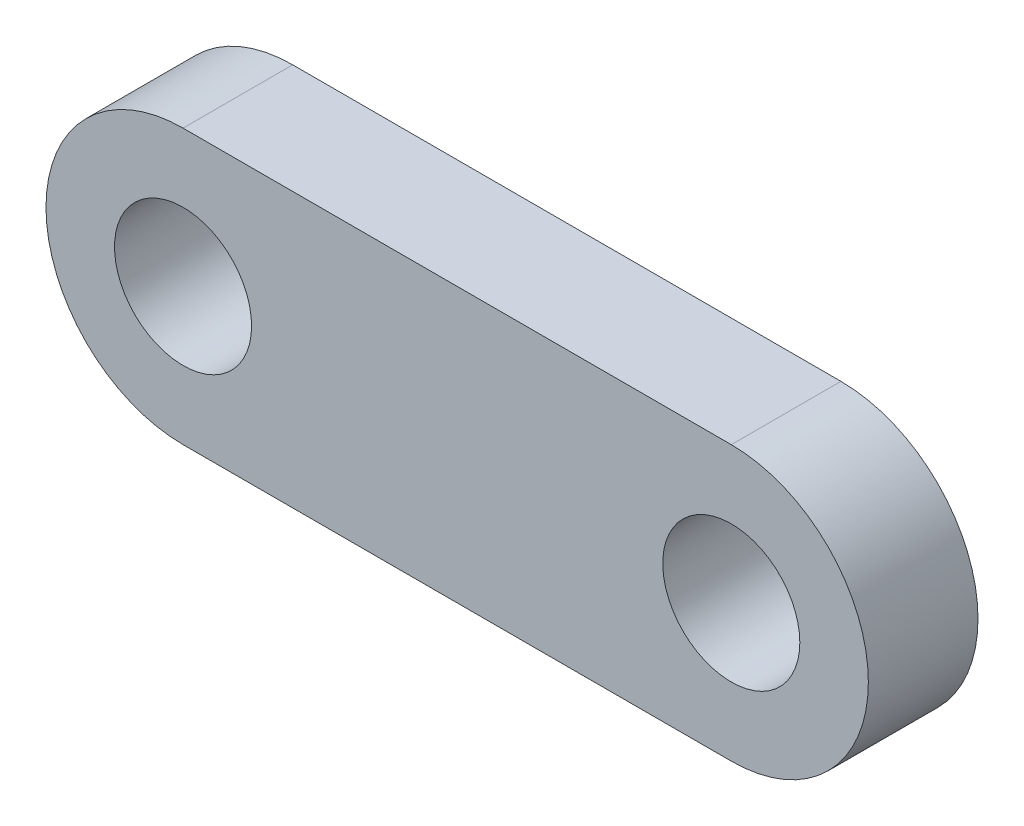
ISO-10303-21;
HEADER;
FILE_DESCRIPTION(('STEP AP214'),'2;1');
FILE_NAME('part.step','',(''),(''),'','','');
FILE_SCHEMA(('AUTOMOTIVE_DESIGN { 1 0 10303 214 1 1 1 1 }'));
ENDSEC;
DATA;
#1=APPLICATION_CONTEXT('core data for automotive mechanical design processes');
#2=APPLICATION_PROTOCOL_DEFINITION('international standard','automotive_design',2000,#1);
#3=PRODUCT_CONTEXT('',#1,'mechanical');
#4=PRODUCT('Part','Part','',(#3));
#5=PRODUCT_RELATED_PRODUCT_CATEGORY('part','',(#4));
#6=PRODUCT_DEFINITION_FORMATION('','',#4);
#7=PRODUCT_DEFINITION_CONTEXT('part definition',#1,'design');
#8=PRODUCT_DEFINITION('design','',#6,#7);
#9=PRODUCT_DEFINITION_SHAPE('','',#8);
#10=(LENGTH_UNIT() NAMED_UNIT(*) SI_UNIT(.MILLI.,.METRE.));
#11=(NAMED_UNIT(*) PLANE_ANGLE_UNIT() SI_UNIT($,.RADIAN.));
#12=(NAMED_UNIT(*) SI_UNIT($,.STERADIAN.) SOLID_ANGLE_UNIT());
#13=UNCERTAINTY_MEASURE_WITH_UNIT(LENGTH_MEASURE(1.E-05),#10,'distance_accuracy_value','');
#14=(GEOMETRIC_REPRESENTATION_CONTEXT(3) GLOBAL_UNCERTAINTY_ASSIGNED_CONTEXT((#13)) GLOBAL_UNIT_ASSIGNED_CONTEXT((#10,
#11,#12)) REPRESENTATION_CONTEXT('',''));
#15=CARTESIAN_POINT('',(0.,0.,0.));
#16=DIRECTION('',(0.,0.,1.));
#17=DIRECTION('',(1.,0.,0.));
#18=AXIS2_PLACEMENT_3D('',#15,#16,#17);
#19=CARTESIAN_POINT('',(-12.7,0.,5.08));
#20=DIRECTION('',(0.,0.,1.));
#21=DIRECTION('',(1.,0.,0.));
#22=AXIS2_PLACEMENT_3D('',#19,#20,#21);
#23=PLANE('',#22);
#24=CARTESIAN_POINT('',(-12.7,0.,5.08));
#25=DIRECTION('',(0.,0.,1.));
#26=DIRECTION('',(1.,0.,0.));
#27=AXIS2_PLACEMENT_3D('',#24,#25,#26);
#28=CIRCLE('',#27,3.175);
#29=CARTESIAN_POINT('',(-9.525,0.,5.08));
#30=VERTEX_POINT('',#29);
#31=EDGE_CURVE('E100',#30,#30,#28,.T.);
#32=ORIENTED_EDGE('',*,*,#31,.F.);
#33=EDGE_LOOP('',(#32));
#34=FACE_BOUND('',#33,.T.);
#35=CARTESIAN_POINT('',(-12.7,0.,5.08));
#36=DIRECTION('',(0.,0.,1.));
#37=DIRECTION('',(1.,0.,0.));
#38=AXIS2_PLACEMENT_3D('',#35,#36,#37);
#39=CIRCLE('',#38,6.35);
#40=CARTESIAN_POINT('',(-12.7,6.35,5.08));
#41=VERTEX_POINT('',#40);
#42=CARTESIAN_POINT('',(-12.7,-6.35,5.08));
#43=VERTEX_POINT('',#42);
#44=EDGE_CURVE('E85',#41,#43,#39,.T.);
#45=ORIENTED_EDGE('',*,*,#44,.T.);
#46=DIRECTION('',(1.,0.,0.));
#47=VECTOR('',#46,1.);
#48=CARTESIAN_POINT('',(-12.7,-6.35,5.08));
#49=LINE('',#48,#47);
#50=CARTESIAN_POINT('',(12.7,-6.35,5.08));
#51=VERTEX_POINT('',#50);
#52=EDGE_CURVE('E80',#43,#51,#49,.T.);
#53=ORIENTED_EDGE('',*,*,#52,.T.);
#54=CARTESIAN_POINT('',(12.7,0.,5.08));
#55=DIRECTION('',(0.,0.,1.));
#56=DIRECTION('',(1.,0.,0.));
#57=AXIS2_PLACEMENT_3D('',#54,#55,#56);
#58=CIRCLE('',#57,6.35);
#59=CARTESIAN_POINT('',(12.7,6.35,5.08));
#60=VERTEX_POINT('',#59);
#61=EDGE_CURVE('E83',#51,#60,#58,.T.);
#62=ORIENTED_EDGE('',*,*,#61,.T.);
#63=DIRECTION('',(-1.,0.,0.));
#64=VECTOR('',#63,1.);
#65=CARTESIAN_POINT('',(-12.7,6.35,5.08));
#66=LINE('',#65,#64);
#67=EDGE_CURVE('E50',#60,#41,#66,.T.);
#68=ORIENTED_EDGE('',*,*,#67,.T.);
#69=EDGE_LOOP('',(#45,#53,#62,#68));
#70=FACE_BOUND('',#69,.T.);
#71=CARTESIAN_POINT('',(12.7,0.,5.08));
#72=DIRECTION('',(0.,0.,1.));
#73=DIRECTION('',(1.,0.,0.));
#74=AXIS2_PLACEMENT_3D('',#71,#72,#73);
#75=CIRCLE('',#74,3.175);
#76=CARTESIAN_POINT('',(15.875,0.,5.08));
#77=VERTEX_POINT('',#76);
#78=EDGE_CURVE('E115',#77,#77,#75,.T.);
#79=ORIENTED_EDGE('',*,*,#78,.F.);
#80=EDGE_LOOP('',(#79));
#81=FACE_BOUND('',#80,.T.);
#82=ADVANCED_FACE('F33',(#34,#70,#81),#23,.T.);
#83=CARTESIAN_POINT('',(-12.7,0.,0.));
#84=DIRECTION('',(0.,0.,1.));
#85=DIRECTION('',(1.,0.,0.));
#86=AXIS2_PLACEMENT_3D('',#83,#84,#85);
#87=PLANE('',#86);
#88=CARTESIAN_POINT('',(-12.7,0.,0.));
#89=DIRECTION('',(0.,0.,1.));
#90=DIRECTION('',(1.,0.,0.));
#91=AXIS2_PLACEMENT_3D('',#88,#89,#90);
#92=CIRCLE('',#91,6.35);
#93=CARTESIAN_POINT('',(-12.7,6.35,0.));
#94=VERTEX_POINT('',#93);
#95=CARTESIAN_POINT('',(-12.7,-6.35,0.));
#96=VERTEX_POINT('',#95);
#97=EDGE_CURVE('E97',#94,#96,#92,.T.);
#98=ORIENTED_EDGE('',*,*,#97,.F.);
#99=DIRECTION('',(-1.,0.,0.));
#100=VECTOR('',#99,1.);
#101=CARTESIAN_POINT('',(-12.7,6.35,0.));
#102=LINE('',#101,#100);
#103=CARTESIAN_POINT('',(12.7,6.35,0.));
#104=VERTEX_POINT('',#103);
#105=EDGE_CURVE('E73',#104,#94,#102,.T.);
#106=ORIENTED_EDGE('',*,*,#105,.F.);
#107=CARTESIAN_POINT('',(12.7,0.,0.));
#108=DIRECTION('',(0.,0.,1.));
#109=DIRECTION('',(1.,0.,0.));
#110=AXIS2_PLACEMENT_3D('',#107,#108,#109);
#111=CIRCLE('',#110,6.35);
#112=CARTESIAN_POINT('',(12.7,-6.35,0.));
#113=VERTEX_POINT('',#112);
#114=EDGE_CURVE('E67',#113,#104,#111,.T.);
#115=ORIENTED_EDGE('',*,*,#114,.F.);
#116=DIRECTION('',(1.,0.,0.));
#117=VECTOR('',#116,1.);
#118=CARTESIAN_POINT('',(-12.7,-6.35,0.));
#119=LINE('',#118,#117);
#120=EDGE_CURVE('E89',#96,#113,#119,.T.);
#121=ORIENTED_EDGE('',*,*,#120,.F.);
#122=EDGE_LOOP('',(#98,#106,#115,#121));
#123=FACE_BOUND('',#122,.T.);
#124=CARTESIAN_POINT('',(-12.7,0.,0.));
#125=DIRECTION('',(0.,0.,1.));
#126=DIRECTION('',(1.,0.,0.));
#127=AXIS2_PLACEMENT_3D('',#124,#125,#126);
#128=CIRCLE('',#127,3.175);
#129=CARTESIAN_POINT('',(-9.525,0.,0.));
#130=VERTEX_POINT('',#129);
#131=EDGE_CURVE('E112',#130,#130,#128,.T.);
#132=ORIENTED_EDGE('',*,*,#131,.T.);
#133=EDGE_LOOP('',(#132));
#134=FACE_BOUND('',#133,.T.);
#135=CARTESIAN_POINT('',(12.7,0.,0.));
#136=DIRECTION('',(0.,0.,1.));
#137=DIRECTION('',(1.,0.,0.));
#138=AXIS2_PLACEMENT_3D('',#135,#136,#137);
#139=CIRCLE('',#138,3.175);
#140=CARTESIAN_POINT('',(15.875,0.,0.));
#141=VERTEX_POINT('',#140);
#142=EDGE_CURVE('E118',#141,#141,#139,.T.);
#143=ORIENTED_EDGE('',*,*,#142,.T.);
#144=EDGE_LOOP('',(#143));
#145=FACE_BOUND('',#144,.T.);
#146=ADVANCED_FACE('F108',(#123,#134,#145),#87,.F.);
#147=CARTESIAN_POINT('',(-12.7,0.,5.08));
#148=DIRECTION('',(0.,0.,-1.));
#149=DIRECTION('',(-1.,0.,0.));
#150=AXIS2_PLACEMENT_3D('',#147,#148,#149);
#151=CYLINDRICAL_SURFACE('',#150,6.35);
#152=ORIENTED_EDGE('',*,*,#97,.T.);
#153=DIRECTION('',(0.,0.,-1.));
#154=VECTOR('',#153,1.);
#155=CARTESIAN_POINT('',(-12.7,-6.35,5.08));
#156=LINE('',#155,#154);
#157=EDGE_CURVE('E11',#43,#96,#156,.T.);
#158=ORIENTED_EDGE('',*,*,#157,.F.);
#159=ORIENTED_EDGE('',*,*,#44,.F.);
#160=DIRECTION('',(0.,0.,-1.));
#161=VECTOR('',#160,1.);
#162=CARTESIAN_POINT('',(-12.7,6.35,5.08));
#163=LINE('',#162,#161);
#164=EDGE_CURVE('E93',#41,#94,#163,.T.);
#165=ORIENTED_EDGE('',*,*,#164,.T.);
#166=EDGE_LOOP('',(#152,#158,#159,#165));
#167=FACE_BOUND('',#166,.T.);
#168=ADVANCED_FACE('F35',(#167),#151,.T.);
#169=CARTESIAN_POINT('',(-12.7,-6.35,5.08));
#170=DIRECTION('',(0.,1.,0.));
#171=DIRECTION('',(0.,0.,1.));
#172=AXIS2_PLACEMENT_3D('',#169,#170,#171);
#173=PLANE('',#172);
#174=ORIENTED_EDGE('',*,*,#120,.T.);
#175=DIRECTION('',(0.,0.,-1.));
#176=VECTOR('',#175,1.);
#177=CARTESIAN_POINT('',(12.7,-6.35,5.08));
#178=LINE('',#177,#176);
#179=EDGE_CURVE('E42',#51,#113,#178,.T.);
#180=ORIENTED_EDGE('',*,*,#179,.F.);
#181=ORIENTED_EDGE('',*,*,#52,.F.);
#182=ORIENTED_EDGE('',*,*,#157,.T.);
#183=EDGE_LOOP('',(#174,#180,#181,#182));
#184=FACE_BOUND('',#183,.T.);
#185=ADVANCED_FACE('F88',(#184),#173,.F.);
#186=CARTESIAN_POINT('',(12.7,0.,5.08));
#187=DIRECTION('',(0.,0.,-1.));
#188=DIRECTION('',(-1.,0.,0.));
#189=AXIS2_PLACEMENT_3D('',#186,#187,#188);
#190=CYLINDRICAL_SURFACE('',#189,6.35);
#191=ORIENTED_EDGE('',*,*,#114,.T.);
#192=DIRECTION('',(0.,0.,-1.));
#193=VECTOR('',#192,1.);
#194=CARTESIAN_POINT('',(12.7,6.35,5.08));
#195=LINE('',#194,#193);
#196=EDGE_CURVE('E90',#60,#104,#195,.T.);
#197=ORIENTED_EDGE('',*,*,#196,.F.);
#198=ORIENTED_EDGE('',*,*,#61,.F.);
#199=ORIENTED_EDGE('',*,*,#179,.T.);
#200=EDGE_LOOP('',(#191,#197,#198,#199));
#201=FACE_BOUND('',#200,.T.);
#202=ADVANCED_FACE('F91',(#201),#190,.T.);
#203=CARTESIAN_POINT('',(-12.7,6.35,5.08));
#204=DIRECTION('',(0.,-1.,0.));
#205=DIRECTION('',(0.,0.,-1.));
#206=AXIS2_PLACEMENT_3D('',#203,#204,#205);
#207=PLANE('',#206);
#208=ORIENTED_EDGE('',*,*,#105,.T.);
#209=ORIENTED_EDGE('',*,*,#164,.F.);
#210=ORIENTED_EDGE('',*,*,#67,.F.);
#211=ORIENTED_EDGE('',*,*,#196,.T.);
#212=EDGE_LOOP('',(#208,#209,#210,#211));
#213=FACE_BOUND('',#212,.T.);
#214=ADVANCED_FACE('F105',(#213),#207,.F.);
#215=CARTESIAN_POINT('',(-12.7,0.,5.08));
#216=DIRECTION('',(0.,0.,-1.));
#217=DIRECTION('',(-1.,0.,0.));
#218=AXIS2_PLACEMENT_3D('',#215,#216,#217);
#219=CYLINDRICAL_SURFACE('',#218,3.175);
#220=ORIENTED_EDGE('',*,*,#31,.T.);
#221=EDGE_LOOP('',(#220));
#222=FACE_BOUND('',#221,.T.);
#223=ORIENTED_EDGE('',*,*,#131,.F.);
#224=EDGE_LOOP('',(#223));
#225=FACE_BOUND('',#224,.T.);
#226=ADVANCED_FACE('F135',(#222,#225),#219,.F.);
#227=CARTESIAN_POINT('',(12.7,0.,5.08));
#228=DIRECTION('',(0.,0.,-1.));
#229=DIRECTION('',(-1.,0.,0.));
#230=AXIS2_PLACEMENT_3D('',#227,#228,#229);
#231=CYLINDRICAL_SURFACE('',#230,3.175);
#232=ORIENTED_EDGE('',*,*,#78,.T.);
#233=EDGE_LOOP('',(#232));
#234=FACE_BOUND('',#233,.T.);
#235=ORIENTED_EDGE('',*,*,#142,.F.);
#236=EDGE_LOOP('',(#235));
#237=FACE_BOUND('',#236,.T.);
#238=ADVANCED_FACE('F124',(#234,#237),#231,.F.);
#239=CLOSED_SHELL('',(#82,#146,#168,#185,#202,#214,#226,#238));
#240=MANIFOLD_SOLID_BREP('B2',#239);
#241=ADVANCED_BREP_SHAPE_REPRESENTATION('',(#18,#240),#14);
#242=SHAPE_DEFINITION_REPRESENTATION(#9,#241);
ENDSEC;
END-ISO-10303-21;
